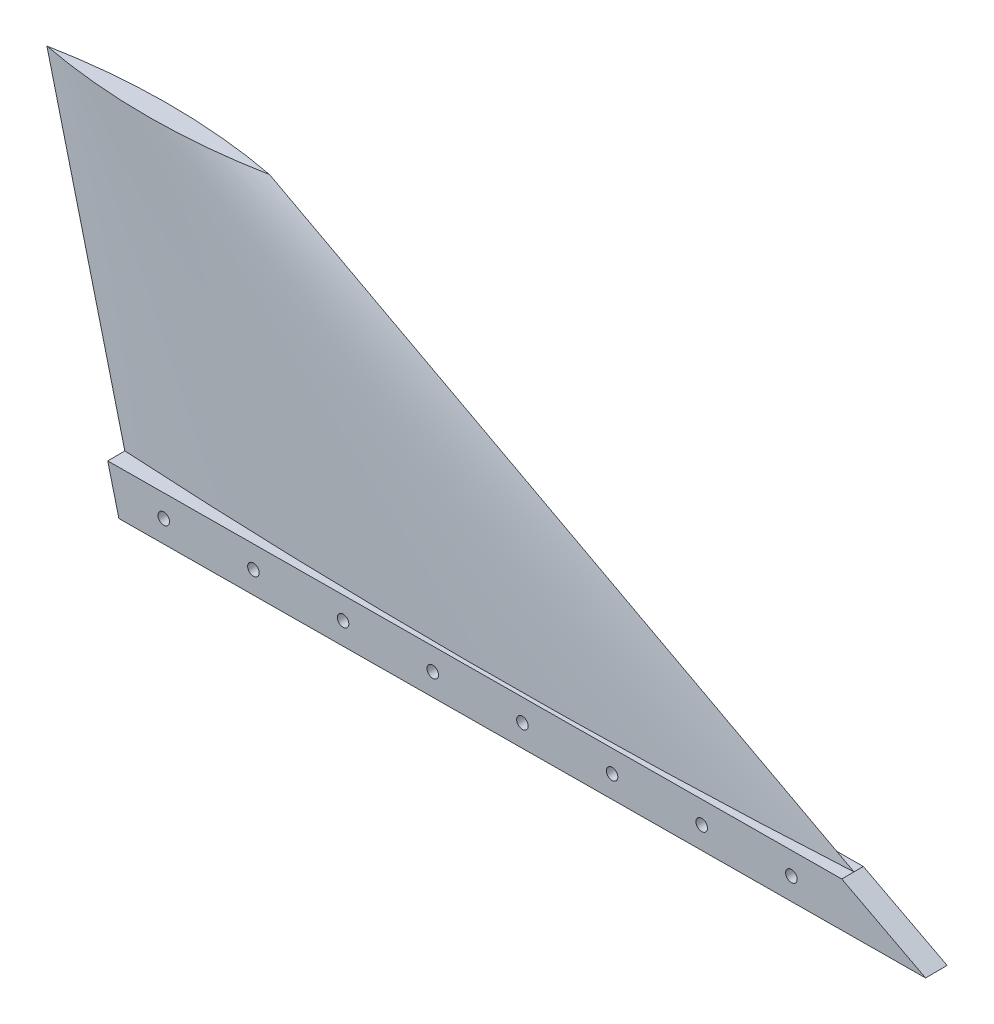
ISO-10303-21;
HEADER;
FILE_DESCRIPTION(('STEP AP214'),'2;1');
FILE_NAME('part.step','',(''),(''),'','','');
FILE_SCHEMA(('AUTOMOTIVE_DESIGN { 1 0 10303 214 1 1 1 1 }'));
ENDSEC;
DATA;
#1=APPLICATION_CONTEXT('core data for automotive mechanical design processes');
#2=APPLICATION_PROTOCOL_DEFINITION('international standard','automotive_design',2000,#1);
#3=PRODUCT_CONTEXT('',#1,'mechanical');
#4=PRODUCT('Part','Part','',(#3));
#5=PRODUCT_RELATED_PRODUCT_CATEGORY('part','',(#4));
#6=PRODUCT_DEFINITION_FORMATION('','',#4);
#7=PRODUCT_DEFINITION_CONTEXT('part definition',#1,'design');
#8=PRODUCT_DEFINITION('design','',#6,#7);
#9=PRODUCT_DEFINITION_SHAPE('','',#8);
#10=(LENGTH_UNIT() NAMED_UNIT(*) SI_UNIT(.MILLI.,.METRE.));
#11=(NAMED_UNIT(*) PLANE_ANGLE_UNIT() SI_UNIT($,.RADIAN.));
#12=(NAMED_UNIT(*) SI_UNIT($,.STERADIAN.) SOLID_ANGLE_UNIT());
#13=UNCERTAINTY_MEASURE_WITH_UNIT(LENGTH_MEASURE(1.E-05),#10,'distance_accuracy_value','');
#14=(GEOMETRIC_REPRESENTATION_CONTEXT(3) GLOBAL_UNCERTAINTY_ASSIGNED_CONTEXT((#13)) GLOBAL_UNIT_ASSIGNED_CONTEXT((#10,
#11,#12)) REPRESENTATION_CONTEXT('',''));
#15=CARTESIAN_POINT('',(0.,0.,0.));
#16=DIRECTION('',(0.,0.,1.));
#17=DIRECTION('',(1.,0.,0.));
#18=AXIS2_PLACEMENT_3D('',#15,#16,#17);
#19=CARTESIAN_POINT('',(-50.7999999999999,203.2,0.));
#20=CARTESIAN_POINT('',(4.9960036108132E-13,0.,0.));
#21=CARTESIAN_POINT('',(-40.4067780264749,203.2,-1.99696806521292));
#22=CARTESIAN_POINT('',(38.0467499197233,0.,-2.01365849787711));
#23=CARTESIAN_POINT('',(-29.872259665938,203.2,-3.51157727112051));
#24=CARTESIAN_POINT('',(76.1334280900938,0.,-3.5249584978771));
#25=CARTESIAN_POINT('',(-8.65839186105809,203.2,-5.53572371619445));
#26=CARTESIAN_POINT('',(152.346731300603,0.,-5.54072924893854));
#27=CARTESIAN_POINT('',(2.0207494933334,203.2,-6.04519999999998));
#28=CARTESIAN_POINT('',(190.473356340742,0.,-6.04519999999999));
#29=CARTESIAN_POINT('',(23.3792505066668,203.2,-6.04519999999996));
#30=CARTESIAN_POINT('',(266.72664365926,0.,-6.04519999999999));
#31=CARTESIAN_POINT('',(34.0583918610582,203.2,-5.53572371619442));
#32=CARTESIAN_POINT('',(304.853268699399,0.,-5.54072924893855));
#33=CARTESIAN_POINT('',(55.2722596659382,203.2,-3.51157727112046));
#34=CARTESIAN_POINT('',(381.066571909908,0.,-3.52495849787711));
#35=CARTESIAN_POINT('',(65.806778026475,203.2,-1.99696806521286));
#36=CARTESIAN_POINT('',(419.153250080279,0.,-2.01365849787711));
#37=CARTESIAN_POINT('',(76.2000000000001,203.2,0.));
#38=CARTESIAN_POINT('',(457.200000000002,0.,0.));
#39=B_SPLINE_SURFACE_WITH_KNOTS('',3,1,((#19,#20),(#21,#22),(#23,#24),(#25,#26),(#27,#28),(#29,
#30),(#31,#32),(#33,#34),(#35,#36),(#37,#38)),.UNSPECIFIED.,.F.,.F.,.F.,(4,2,2,2,4),(2,2),(0.,
0.25,0.5,0.75,1.),(0.,1.),.UNSPECIFIED.);
#40=CARTESIAN_POINT('',(409.575000000002,25.3999999999999,0.));
#41=CARTESIAN_POINT('',(405.617284288982,25.3999999999999,-0.230159422859951));
#42=CARTESIAN_POINT('',(401.659186992657,25.3999999999999,-0.453757299244652));
#43=CARTESIAN_POINT('',(393.742490502231,25.3999999999999,-0.887815238556678));
#44=CARTESIAN_POINT('',(389.783891347722,25.3999999999999,-1.09827602356698));
#45=CARTESIAN_POINT('',(381.866191220855,25.3999999999999,-1.5060614084114));
#46=CARTESIAN_POINT('',(377.907090278258,25.3999999999999,-1.7033865860972));
#47=CARTESIAN_POINT('',(369.988386598123,25.3999999999999,-2.08490122361017));
#48=CARTESIAN_POINT('',(366.028783881475,25.3999999999999,-2.2690911170559));
#49=CARTESIAN_POINT('',(358.109076626838,25.3999999999999,-2.62433464868725));
#50=CARTESIAN_POINT('',(354.148972101825,25.3999999999999,-2.79538857618817));
#51=CARTESIAN_POINT('',(346.228261152961,25.3999999999999,-3.12435859982126));
#52=CARTESIAN_POINT('',(342.267654735127,25.3999999999999,-3.282274840836));
#53=CARTESIAN_POINT('',(334.345939514585,25.3999999999999,-3.58496687564327));
#54=CARTESIAN_POINT('',(330.384830711843,25.3999999999999,-3.72974266851041));
#55=CARTESIAN_POINT('',(322.462110932088,25.3999999999999,-4.00615020320668));
#56=CARTESIAN_POINT('',(318.500499950033,25.3999999999999,-4.13778180052325));
#57=CARTESIAN_POINT('',(310.576775670252,25.3999999999999,-4.3878960287497));
#58=CARTESIAN_POINT('',(306.614662363391,25.3999999999999,-4.50637837027509));
#59=CARTESIAN_POINT('',(298.689933302163,25.3999999999999,-4.73018927112992));
#60=CARTESIAN_POINT('',(294.727317535523,25.3999999999999,-4.83551739593918));
#61=CARTESIAN_POINT('',(286.801583516773,25.3999999999999,-5.03301855933534));
#62=CARTESIAN_POINT('',(282.838465250217,25.3999999999999,-5.12519101822138));
#63=CARTESIAN_POINT('',(274.911726144868,25.3999999999999,-5.29637782965518));
#64=CARTESIAN_POINT('',(270.948105290416,25.3999999999999,-5.37539145713993));
#65=CARTESIAN_POINT('',(266.984364133269,25.3999999999999,-5.44782183625952));
#66=B_SPLINE_CURVE_WITH_KNOTS('',3,(#40,#41,#42,#43,#44,#45,#46,#47,#48,#49,#50,#51,#52,#53,#54,
#55,#56,#57,#58,#59,#60,#61,#62,#63,#64,#65),.UNSPECIFIED.,.F.,.F.,(4,2,2,2,2,2,2,2,2,2,2,2,4),
(0.,11.8932019876838,23.785749686346,35.6777738708504,47.5694052970654,59.4607747388702,
71.3520130251158,83.2432521487796,95.1346219951143,107.026253490935,118.9182776964,
130.810825759022,142.704028894698),.UNSPECIFIED.);
#67=CARTESIAN_POINT('',(409.575000000001,25.3999999999999,0.));
#68=VERTEX_POINT('',#67);
#69=CARTESIAN_POINT('',(302.34021952781,25.3999999999999,-4.62708393592184));
#70=VERTEX_POINT('',#69);
#71=EDGE_CURVE('E181',#68,#70,#66,.T.);
#72=CARTESIAN_POINT('',(368.255113336555,25.3999999999999,-2.16387500239286));
#73=CARTESIAN_POINT('',(340.524015942744,25.3999999999999,-3.45581743465727));
#74=CARTESIAN_POINT('',(312.777888037133,25.3999999999999,-4.42562159020704));
#75=CARTESIAN_POINT('',(257.285612769027,25.3999999999999,-5.71943481517913));
#76=CARTESIAN_POINT('',(229.539473549342,25.3999999999999,-6.04379322302056));
#77=CARTESIAN_POINT('',(173.986921811786,25.3999999999999,-6.04660067572226));
#78=CARTESIAN_POINT('',(146.180509214145,25.3999999999999,-5.72364592991431));
#79=CARTESIAN_POINT('',(90.5676544876334,25.3999999999999,-4.42983416101489));
#80=CARTESIAN_POINT('',(62.7612205369764,25.3999999999999,-3.45862551761243));
#81=CARTESIAN_POINT('',(34.9698866634471,25.4,-2.16387500239286));
#82=B_SPLINE_CURVE_WITH_KNOTS('',3,(#72,#73,#74,#75,#76,#77,#78,#79,#80,#81),.UNSPECIFIED.,.F.,
.F.,(4,2,2,2,4),(0.,83.2816902927023,166.518293270393,249.935601969556,333.398193977609),.UNSPECIFIED.);
#83=CARTESIAN_POINT('',(52.1819470576683,25.3999999999999,-2.9242842904022));
#84=VERTEX_POINT('',#83);
#85=EDGE_CURVE('E138',#70,#84,#82,.T.);
#86=CARTESIAN_POINT('',(136.240635866734,25.3999999999999,-5.44782183625952));
#87=CARTESIAN_POINT('',(132.276894709587,25.3999999999999,-5.37539145713992));
#88=CARTESIAN_POINT('',(128.313273855135,25.3999999999999,-5.29637782965517));
#89=CARTESIAN_POINT('',(120.386534749785,25.3999999999999,-5.12519101822138));
#90=CARTESIAN_POINT('',(116.42341648323,25.3999999999999,-5.03301855933534));
#91=CARTESIAN_POINT('',(108.49768246448,25.3999999999999,-4.83551739593918));
#92=CARTESIAN_POINT('',(104.53506669784,25.3999999999999,-4.73018927112991));
#93=CARTESIAN_POINT('',(96.6103376366108,25.3999999999999,-4.50637837027508));
#94=CARTESIAN_POINT('',(92.6482243297502,25.3999999999999,-4.38789602874969));
#95=CARTESIAN_POINT('',(84.7245000499694,25.3999999999999,-4.13778180052324));
#96=CARTESIAN_POINT('',(80.7628890679146,25.3999999999999,-4.00615020320668));
#97=CARTESIAN_POINT('',(72.8401692881592,25.3999999999999,-3.72974266851041));
#98=CARTESIAN_POINT('',(68.8790604854168,25.3999999999999,-3.58496687564327));
#99=CARTESIAN_POINT('',(60.9573452648755,25.3999999999999,-3.282274840836));
#100=CARTESIAN_POINT('',(56.9967388470412,25.3999999999999,-3.12435859982127));
#101=CARTESIAN_POINT('',(49.0760278981769,25.3999999999999,-2.79538857618817));
#102=CARTESIAN_POINT('',(45.1159233731642,25.3999999999999,-2.62433464868724));
#103=CARTESIAN_POINT('',(37.1962161185267,25.3999999999999,-2.26909111705587));
#104=CARTESIAN_POINT('',(33.2366134018793,25.3999999999999,-2.08490122361013));
#105=CARTESIAN_POINT('',(25.317909721744,25.3999999999999,-1.70338658609715));
#106=CARTESIAN_POINT('',(21.3588087791474,25.3999999999999,-1.50606140841135));
#107=CARTESIAN_POINT('',(13.4411086522802,25.3999999999999,-1.09827602356695));
#108=CARTESIAN_POINT('',(9.48250949777067,25.3999999999999,-0.887815238556656));
#109=CARTESIAN_POINT('',(1.56581300734518,25.3999999999999,-0.453757299244651));
#110=CARTESIAN_POINT('',(-2.39228428898033,25.3999999999999,-0.230159422859958));
#111=CARTESIAN_POINT('',(-6.34999999999954,25.4,0.));
#112=B_SPLINE_CURVE_WITH_KNOTS('',3,(#86,#87,#88,#89,#90,#91,#92,#93,#94,#95,#96,#97,#98,#99,
#100,#101,#102,#103,#104,#105,#106,#107,#108,#109,#110,#111),.UNSPECIFIED.,.F.,.F.,(4,2,2,2,2,2,
2,2,2,2,2,2,4),(0.,11.8932031356756,23.7857511982973,35.6777754037628,47.5694068995834,
59.460776745918,71.3520158695819,83.2432541558274,95.1346235976323,107.026255023847,
118.918279208352,130.810826907014,142.704028894698),.UNSPECIFIED.);
#113=CARTESIAN_POINT('',(-6.34999999999975,25.4,0.));
#114=VERTEX_POINT('',#113);
#115=EDGE_CURVE('E51',#84,#114,#112,.T.);
#116=DIRECTION('',(-0.242535625036335,0.970142500145331,0.));
#117=VECTOR('',#116,1.);
#118=CARTESIAN_POINT('',(-25.3999999999997,101.6,0.));
#119=LINE('',#118,#117);
#120=CARTESIAN_POINT('',(-50.8,203.2,0.));
#121=VERTEX_POINT('',#120);
#122=EDGE_CURVE('E160',#114,#121,#119,.T.);
#123=CARTESIAN_POINT('',(-50.7999999999999,203.2,0.));
#124=CARTESIAN_POINT('',(-40.4067780264749,203.2,-1.99696806521292));
#125=CARTESIAN_POINT('',(-29.872259665938,203.2,-3.51157727112051));
#126=CARTESIAN_POINT('',(-8.65839186105809,203.2,-5.53572371619445));
#127=CARTESIAN_POINT('',(2.0207494933334,203.2,-6.04519999999998));
#128=CARTESIAN_POINT('',(23.3792505066668,203.2,-6.04519999999996));
#129=CARTESIAN_POINT('',(34.0583918610582,203.2,-5.53572371619442));
#130=CARTESIAN_POINT('',(55.2722596659382,203.2,-3.51157727112046));
#131=CARTESIAN_POINT('',(65.806778026475,203.2,-1.99696806521286));
#132=CARTESIAN_POINT('',(76.2000000000001,203.2,0.));
#133=B_SPLINE_CURVE_WITH_KNOTS('',3,(#123,#124,#125,#126,#127,#128,#129,#130,#131,#132),
.UNSPECIFIED.,.F.,.F.,(4,2,2,2,4),(0.,0.25,0.5,0.75,1.),.UNSPECIFIED.);
#134=CARTESIAN_POINT('',(76.2,203.2,0.));
#135=VERTEX_POINT('',#134);
#136=EDGE_CURVE('E286',#121,#135,#133,.T.);
#137=DIRECTION('',(0.882352941176471,-0.470588235294116,0.));
#138=VECTOR('',#137,1.);
#139=CARTESIAN_POINT('',(266.700000000001,101.6,0.));
#140=LINE('',#139,#138);
#141=EDGE_CURVE('E283',#135,#68,#140,.T.);
#142=ORIENTED_EDGE('',*,*,#71,.T.);
#143=ORIENTED_EDGE('',*,*,#85,.T.);
#144=ORIENTED_EDGE('',*,*,#115,.T.);
#145=ORIENTED_EDGE('',*,*,#122,.T.);
#146=ORIENTED_EDGE('',*,*,#136,.T.);
#147=ORIENTED_EDGE('',*,*,#141,.T.);
#148=EDGE_LOOP('',(#142,#143,#144,#145,#146,#147));
#149=FACE_BOUND('',#148,.T.);
#150=ADVANCED_FACE('F41',(#149),#39,.T.);
#151=CARTESIAN_POINT('',(76.1999999999999,203.2,0.));
#152=CARTESIAN_POINT('',(457.200000000001,0.,0.));
#153=CARTESIAN_POINT('',(65.8067780264749,203.2,1.99696806521292));
#154=CARTESIAN_POINT('',(419.153250080278,0.,2.01365849787711));
#155=CARTESIAN_POINT('',(55.272259665938,203.2,3.51157727112051));
#156=CARTESIAN_POINT('',(381.066571909907,0.,3.5249584978771));
#157=CARTESIAN_POINT('',(34.0583918610581,203.2,5.53572371619445));
#158=CARTESIAN_POINT('',(304.853268699398,0.,5.54072924893854));
#159=CARTESIAN_POINT('',(23.3792505066666,203.2,6.04519999999998));
#160=CARTESIAN_POINT('',(266.726643659259,0.,6.04519999999999));
#161=CARTESIAN_POINT('',(2.02074949333326,203.2,6.04519999999997));
#162=CARTESIAN_POINT('',(190.473356340741,0.,6.04519999999999));
#163=CARTESIAN_POINT('',(-8.65839186105825,203.2,5.53572371619443));
#164=CARTESIAN_POINT('',(152.346731300602,0.,5.54072924893855));
#165=CARTESIAN_POINT('',(-29.8722596659381,203.2,3.51157727112046));
#166=CARTESIAN_POINT('',(76.1334280900927,0.,3.52495849787711));
#167=CARTESIAN_POINT('',(-40.406778026475,203.2,1.99696806521286));
#168=CARTESIAN_POINT('',(38.0467499197222,0.,2.01365849787711));
#169=CARTESIAN_POINT('',(-50.8000000000001,203.2,0.));
#170=CARTESIAN_POINT('',(-6.05799965640216E-13,0.,0.));
#171=B_SPLINE_SURFACE_WITH_KNOTS('',3,1,((#151,#152),(#153,#154),(#155,#156),(#157,#158),(#159,
#160),(#161,#162),(#163,#164),(#165,#166),(#167,#168),(#169,#170)),.UNSPECIFIED.,.F.,.F.,.F.,(4,
2,2,2,4),(2,2),(0.,0.25,0.5,0.75,1.),(0.,1.),.UNSPECIFIED.);
#172=CARTESIAN_POINT('',(-6.35000000000053,25.3999999999999,0.));
#173=CARTESIAN_POINT('',(11.7496158182469,25.3999999999999,1.05254968895178));
#174=CARTESIAN_POINT('',(29.8572152505244,25.3999999999999,1.96792103108589));
#175=CARTESIAN_POINT('',(66.0839938436366,25.3999999999999,3.52385650230203));
#176=CARTESIAN_POINT('',(84.2031728597438,25.3999999999999,4.16442400125636));
#177=CARTESIAN_POINT('',(120.449176020014,25.3999999999999,5.17032734707695));
#178=CARTESIAN_POINT('',(138.576000167875,25.3999999999999,5.53566306064736));
#179=CARTESIAN_POINT('',(174.833344857813,25.3999999999999,5.99084469241214));
#180=CARTESIAN_POINT('',(192.963865442498,25.3999999999999,6.08068723181068));
#181=CARTESIAN_POINT('',(227.642965575726,25.3999999999999,5.98875977047559));
#182=CARTESIAN_POINT('',(244.191610520529,25.3999999999999,5.82999419639645));
#183=CARTESIAN_POINT('',(277.285310522527,25.3999999999999,5.28301370619817));
#184=CARTESIAN_POINT('',(293.830365535872,25.3999999999999,4.89479612954149));
#185=CARTESIAN_POINT('',(326.914959113583,25.3999999999999,3.88902955119503));
#186=CARTESIAN_POINT('',(343.454497063326,25.3999999999999,3.27146034278064));
#187=CARTESIAN_POINT('',(376.523239649135,25.3999999999999,1.80736024373821));
#188=CARTESIAN_POINT('',(393.052444405534,25.3999999999999,0.960832071143282));
#189=CARTESIAN_POINT('',(409.575000000001,25.4,0.));
#190=B_SPLINE_CURVE_WITH_KNOTS('',3,(#172,#173,#174,#175,#176,#177,#178,#179,#180,#181,#182,
#183,#184,#185,#186,#187,#188,#189),.UNSPECIFIED.,.F.,.F.,(4,2,2,2,2,2,2,2,4),(0.,
54.3900733211052,108.779479647025,163.168912313935,217.559012039306,267.205665734861,
316.85289510365,366.504499614531,416.155514723799),.UNSPECIFIED.);
#191=EDGE_CURVE('E151',#114,#68,#190,.T.);
#192=CARTESIAN_POINT('',(76.1999999999999,203.2,0.));
#193=CARTESIAN_POINT('',(65.8067780264749,203.2,1.99696806521292));
#194=CARTESIAN_POINT('',(55.272259665938,203.2,3.51157727112051));
#195=CARTESIAN_POINT('',(34.0583918610581,203.2,5.53572371619445));
#196=CARTESIAN_POINT('',(23.3792505066666,203.2,6.04519999999998));
#197=CARTESIAN_POINT('',(2.02074949333326,203.2,6.04519999999997));
#198=CARTESIAN_POINT('',(-8.65839186105825,203.2,5.53572371619443));
#199=CARTESIAN_POINT('',(-29.8722596659381,203.2,3.51157727112046));
#200=CARTESIAN_POINT('',(-40.406778026475,203.2,1.99696806521286));
#201=CARTESIAN_POINT('',(-50.8000000000001,203.2,0.));
#202=B_SPLINE_CURVE_WITH_KNOTS('',3,(#192,#193,#194,#195,#196,#197,#198,#199,#200,#201),
.UNSPECIFIED.,.F.,.F.,(4,2,2,2,4),(0.,0.25,0.5,0.75,1.),.UNSPECIFIED.);
#203=EDGE_CURVE('E65',#135,#121,#202,.T.);
#204=ORIENTED_EDGE('',*,*,#122,.F.);
#205=ORIENTED_EDGE('',*,*,#191,.T.);
#206=ORIENTED_EDGE('',*,*,#141,.F.);
#207=ORIENTED_EDGE('',*,*,#203,.T.);
#208=EDGE_LOOP('',(#204,#205,#206,#207));
#209=FACE_BOUND('',#208,.T.);
#210=ADVANCED_FACE('F162',(#209),#171,.T.);
#211=CARTESIAN_POINT('',(12.7,203.2,0.));
#212=DIRECTION('',(0.,1.,0.));
#213=DIRECTION('',(0.,0.,1.));
#214=AXIS2_PLACEMENT_3D('',#211,#212,#213);
#215=PLANE('',#214);
#216=ORIENTED_EDGE('',*,*,#203,.F.);
#217=ORIENTED_EDGE('',*,*,#136,.F.);
#218=EDGE_LOOP('',(#216,#217));
#219=FACE_BOUND('',#218,.T.);
#220=ADVANCED_FACE('F43',(#219),#215,.T.);
#221=CARTESIAN_POINT('',(409.622562069821,25.3999999999999,6.98734302207143));
#222=DIRECTION('',(-0.470585821016416,-0.882348414405783,0.00320322554717419));
#223=DIRECTION('',(0.882352941176471,-0.470588235294116,0.));
#224=AXIS2_PLACEMENT_3D('',#221,#222,#223);
#225=PLANE('',#224);
#226=DIRECTION('',(-0.882327973864772,0.470596722890842,0.00600590876445357));
#227=VECTOR('',#226,1.);
#228=CARTESIAN_POINT('',(409.622562069821,25.3999999999999,6.98734302207143));
#229=LINE('',#228,#227);
#230=CARTESIAN_POINT('',(457.102487147281,0.076200000000919,6.66415243239845));
#231=VERTEX_POINT('',#230);
#232=CARTESIAN_POINT('',(409.622562069821,25.3999999999999,6.98734302207143));
#233=VERTEX_POINT('',#232);
#234=EDGE_CURVE('E130',#231,#233,#229,.T.);
#235=ORIENTED_EDGE('',*,*,#234,.F.);
#236=DIRECTION('',(-0.00680673152056182,0.,-0.99997683393467));
#237=VECTOR('',#236,1.);
#238=CARTESIAN_POINT('',(457.102487147281,0.0762000000009214,6.66415243239845));
#239=LINE('',#238,#237);
#240=CARTESIAN_POINT('',(457.018462130699,0.0762000000009191,-5.6799615964247));
#241=VERTEX_POINT('',#240);
#242=EDGE_CURVE('E57',#231,#241,#239,.T.);
#243=ORIENTED_EDGE('',*,*,#242,.T.);
#244=DIRECTION('',(-0.882327973864772,0.470596722890842,0.00600590876445357));
#245=VECTOR('',#244,1.);
#246=CARTESIAN_POINT('',(409.538537053238,25.3999999999999,-5.35677100675171));
#247=LINE('',#246,#245);
#248=CARTESIAN_POINT('',(409.538537053238,25.3999999999999,-5.35677100675171));
#249=VERTEX_POINT('',#248);
#250=EDGE_CURVE('E134',#241,#249,#247,.T.);
#251=ORIENTED_EDGE('',*,*,#250,.T.);
#252=DIRECTION('',(-0.00680673152056181,0.,-0.99997683393467));
#253=VECTOR('',#252,1.);
#254=CARTESIAN_POINT('',(409.622562069821,25.3999999999999,6.98734302207143));
#255=LINE('',#254,#253);
#256=EDGE_CURVE('E146',#68,#249,#255,.T.);
#257=ORIENTED_EDGE('',*,*,#256,.F.);
#258=EDGE_CURVE('E147',#233,#68,#255,.T.);
#259=ORIENTED_EDGE('',*,*,#258,.F.);
#260=EDGE_LOOP('',(#235,#243,#251,#257,#259));
#261=FACE_BOUND('',#260,.T.);
#262=ADVANCED_FACE('F177',(#261),#225,.F.);
#263=CARTESIAN_POINT('',(-6.28316746194906,25.3999999999999,9.81836724454967));
#264=DIRECTION('',(0.,-1.,0.));
#265=DIRECTION('',(0.,0.,-1.));
#266=AXIS2_PLACEMENT_3D('',#263,#264,#265);
#267=PLANE('',#266);
#268=ORIENTED_EDGE('',*,*,#71,.F.);
#269=ORIENTED_EDGE('',*,*,#256,.T.);
#270=DIRECTION('',(-0.99997683393467,0.,0.00680673152056181));
#271=VECTOR('',#270,1.);
#272=CARTESIAN_POINT('',(-6.36719247853149,25.3999999999999,-2.52574678427348));
#273=LINE('',#272,#271);
#274=EDGE_CURVE('E139',#249,#70,#273,.T.);
#275=ORIENTED_EDGE('',*,*,#274,.T.);
#276=EDGE_LOOP('',(#268,#269,#275));
#277=FACE_BOUND('',#276,.T.);
#278=ADVANCED_FACE('F174',(#277),#267,.F.);
#279=ORIENTED_EDGE('',*,*,#191,.F.);
#280=DIRECTION('',(-0.00680673152056181,0.,-0.99997683393467));
#281=VECTOR('',#280,1.);
#282=CARTESIAN_POINT('',(-6.28316746194906,25.3999999999999,9.81836724454967));
#283=LINE('',#282,#281);
#284=CARTESIAN_POINT('',(-6.28316746194906,25.3999999999999,9.81836724454967));
#285=VERTEX_POINT('',#284);
#286=EDGE_CURVE('E128',#285,#114,#283,.T.);
#287=ORIENTED_EDGE('',*,*,#286,.F.);
#288=DIRECTION('',(-0.99997683393467,0.,0.00680673152056181));
#289=VECTOR('',#288,1.);
#290=CARTESIAN_POINT('',(-6.28316746194906,25.3999999999999,9.81836724454967));
#291=LINE('',#290,#289);
#292=EDGE_CURVE('E121',#233,#285,#291,.T.);
#293=ORIENTED_EDGE('',*,*,#292,.F.);
#294=ORIENTED_EDGE('',*,*,#258,.T.);
#295=EDGE_LOOP('',(#279,#287,#293,#294));
#296=FACE_BOUND('',#295,.T.);
#297=ADVANCED_FACE('F175',(#296),#267,.F.);
#298=CARTESIAN_POINT('',(0.0665383324290176,9.20097331658098E-13,9.77514550069504));
#299=DIRECTION('',(0.970121347740176,0.242530336935051,-0.00660350853374306));
#300=DIRECTION('',(-0.24253562503634,0.97014250014533,0.));
#301=AXIS2_PLACEMENT_3D('',#298,#299,#300);
#302=PLANE('',#301);
#303=DIRECTION('',(0.242524718461421,-0.970143822155339,-0.00165083888910828));
#304=VECTOR('',#303,1.);
#305=CARTESIAN_POINT('',(-0.0174866841534056,9.20097331658098E-13,-2.56896852812811));
#306=LINE('',#305,#304);
#307=CARTESIAN_POINT('',(-6.36719247853149,25.3999999999999,-2.52574678427348));
#308=VERTEX_POINT('',#307);
#309=CARTESIAN_POINT('',(-0.0365358015365403,0.0762000000009215,-2.56883886289654));
#310=VERTEX_POINT('',#309);
#311=EDGE_CURVE('E114',#308,#310,#306,.T.);
#312=ORIENTED_EDGE('',*,*,#311,.T.);
#313=DIRECTION('',(0.00680673152056179,0.,0.99997683393467));
#314=VECTOR('',#313,1.);
#315=CARTESIAN_POINT('',(-0.0625627527611331,0.0762000000009215,-6.39245790882482));
#316=LINE('',#315,#314);
#317=CARTESIAN_POINT('',(0.0474892150458827,0.0762000000009214,9.7752751659266));
#318=VERTEX_POINT('',#317);
#319=EDGE_CURVE('E102',#310,#318,#316,.T.);
#320=ORIENTED_EDGE('',*,*,#319,.T.);
#321=DIRECTION('',(0.242524718461421,-0.970143822155339,-0.00165083888910828));
#322=VECTOR('',#321,1.);
#323=CARTESIAN_POINT('',(0.0665383324290176,9.20097331658098E-13,9.77514550069504));
#324=LINE('',#323,#322);
#325=EDGE_CURVE('E112',#285,#318,#324,.T.);
#326=ORIENTED_EDGE('',*,*,#325,.F.);
#327=ORIENTED_EDGE('',*,*,#286,.T.);
#328=EDGE_CURVE('E124',#114,#308,#283,.T.);
#329=ORIENTED_EDGE('',*,*,#328,.T.);
#330=EDGE_LOOP('',(#312,#320,#326,#327,#329));
#331=FACE_BOUND('',#330,.T.);
#332=ADVANCED_FACE('F110',(#331),#302,.F.);
#333=CARTESIAN_POINT('',(-0.0174866841534083,0.,-2.56896852812811));
#334=DIRECTION('',(0.00680673152056181,0.,0.99997683393467));
#335=DIRECTION('',(0.99997683393467,0.,-0.00680673152056181));
#336=AXIS2_PLACEMENT_3D('',#333,#334,#335);
#337=PLANE('',#336);
#338=CARTESIAN_POINT('',(380.965449382963,12.7,-5.16227716460963));
#339=DIRECTION('',(0.00680673152056181,0.,0.99997683393467));
#340=DIRECTION('',(0.99997683393467,0.,-0.00680673152056181));
#341=AXIS2_PLACEMENT_3D('',#338,#339,#340);
#342=CIRCLE('',#341,3.26389999999999);
#343=CARTESIAN_POINT('',(384.229273771243,12.7,-5.18449365561959));
#344=VERTEX_POINT('',#343);
#345=EDGE_CURVE('E243',#344,#344,#342,.T.);
#346=ORIENTED_EDGE('',*,*,#345,.T.);
#347=EDGE_LOOP('',(#346));
#348=FACE_BOUND('',#347,.T.);
#349=CARTESIAN_POINT('',(330.167803027938,12.7,-4.81650321377259));
#350=DIRECTION('',(0.00680673152056181,0.,0.99997683393467));
#351=DIRECTION('',(0.99997683393467,0.,-0.00680673152056181));
#352=AXIS2_PLACEMENT_3D('',#349,#350,#351);
#353=CIRCLE('',#352,3.26389999999999);
#354=CARTESIAN_POINT('',(333.431627416217,12.7,-4.83871970478255));
#355=VERTEX_POINT('',#354);
#356=EDGE_CURVE('E247',#355,#355,#353,.T.);
#357=ORIENTED_EDGE('',*,*,#356,.T.);
#358=EDGE_LOOP('',(#357));
#359=FACE_BOUND('',#358,.T.);
#360=CARTESIAN_POINT('',(279.370156672913,12.7,-4.47072926293556));
#361=DIRECTION('',(0.00680673152056181,0.,0.99997683393467));
#362=DIRECTION('',(0.99997683393467,0.,-0.00680673152056181));
#363=AXIS2_PLACEMENT_3D('',#360,#361,#362);
#364=CIRCLE('',#363,3.26389999999999);
#365=CARTESIAN_POINT('',(282.633981061192,12.7,-4.49294575394552));
#366=VERTEX_POINT('',#365);
#367=EDGE_CURVE('E251',#366,#366,#364,.T.);
#368=ORIENTED_EDGE('',*,*,#367,.T.);
#369=EDGE_LOOP('',(#368));
#370=FACE_BOUND('',#369,.T.);
#371=CARTESIAN_POINT('',(228.572510317888,12.7,-4.12495531209852));
#372=DIRECTION('',(0.00680673152056181,0.,0.99997683393467));
#373=DIRECTION('',(0.99997683393467,0.,-0.00680673152056181));
#374=AXIS2_PLACEMENT_3D('',#371,#372,#373);
#375=CIRCLE('',#374,3.26389999999999);
#376=CARTESIAN_POINT('',(231.836334706167,12.7,-4.14717180310848));
#377=VERTEX_POINT('',#376);
#378=EDGE_CURVE('E255',#377,#377,#375,.T.);
#379=ORIENTED_EDGE('',*,*,#378,.T.);
#380=EDGE_LOOP('',(#379));
#381=FACE_BOUND('',#380,.T.);
#382=CARTESIAN_POINT('',(177.774863962863,12.7,-3.77918136126148));
#383=DIRECTION('',(0.00680673152056181,0.,0.99997683393467));
#384=DIRECTION('',(0.99997683393467,0.,-0.00680673152056181));
#385=AXIS2_PLACEMENT_3D('',#382,#383,#384);
#386=CIRCLE('',#385,3.26389999999999);
#387=CARTESIAN_POINT('',(181.038688351142,12.7,-3.80139785227145));
#388=VERTEX_POINT('',#387);
#389=EDGE_CURVE('E259',#388,#388,#386,.T.);
#390=ORIENTED_EDGE('',*,*,#389,.T.);
#391=EDGE_LOOP('',(#390));
#392=FACE_BOUND('',#391,.T.);
#393=CARTESIAN_POINT('',(126.977217607838,12.7,-3.43340741042445));
#394=DIRECTION('',(0.00680673152056181,0.,0.99997683393467));
#395=DIRECTION('',(0.99997683393467,0.,-0.00680673152056181));
#396=AXIS2_PLACEMENT_3D('',#393,#394,#395);
#397=CIRCLE('',#396,3.26389999999999);
#398=CARTESIAN_POINT('',(130.241041996117,12.7,-3.45562390143441));
#399=VERTEX_POINT('',#398);
#400=EDGE_CURVE('E263',#399,#399,#397,.T.);
#401=ORIENTED_EDGE('',*,*,#400,.T.);
#402=EDGE_LOOP('',(#401));
#403=FACE_BOUND('',#402,.T.);
#404=CARTESIAN_POINT('',(76.1795712528124,12.7,-3.08763345958741));
#405=DIRECTION('',(0.00680673152056181,0.,0.99997683393467));
#406=DIRECTION('',(0.99997683393467,0.,-0.00680673152056181));
#407=AXIS2_PLACEMENT_3D('',#404,#405,#406);
#408=CIRCLE('',#407,3.26389999999999);
#409=CARTESIAN_POINT('',(79.4433956410917,12.7,-3.10984995059737));
#410=VERTEX_POINT('',#409);
#411=EDGE_CURVE('E267',#410,#410,#408,.T.);
#412=ORIENTED_EDGE('',*,*,#411,.T.);
#413=EDGE_LOOP('',(#412));
#414=FACE_BOUND('',#413,.T.);
#415=CARTESIAN_POINT('',(25.3819248977872,12.7,-2.74185950875037));
#416=DIRECTION('',(0.00680673152056181,0.,0.99997683393467));
#417=DIRECTION('',(0.99997683393467,0.,-0.00680673152056181));
#418=AXIS2_PLACEMENT_3D('',#415,#416,#417);
#419=CIRCLE('',#418,3.26389999999999);
#420=CARTESIAN_POINT('',(28.6457492860666,12.7,-2.76407599976034));
#421=VERTEX_POINT('',#420);
#422=EDGE_CURVE('E195',#421,#421,#419,.T.);
#423=ORIENTED_EDGE('',*,*,#422,.T.);
#424=EDGE_LOOP('',(#423));
#425=FACE_BOUND('',#424,.T.);
#426=ORIENTED_EDGE('',*,*,#250,.F.);
#427=DIRECTION('',(-0.99997683393467,0.,0.00680673152056181));
#428=VECTOR('',#427,1.);
#429=CARTESIAN_POINT('',(-0.0174866841534083,0.0762000000009215,-2.56896852812811));
#430=LINE('',#429,#428);
#431=EDGE_CURVE('E116',#241,#310,#430,.T.);
#432=ORIENTED_EDGE('',*,*,#431,.T.);
#433=ORIENTED_EDGE('',*,*,#311,.F.);
#434=EDGE_CURVE('E137',#84,#308,#273,.T.);
#435=ORIENTED_EDGE('',*,*,#434,.F.);
#436=DIRECTION('',(-0.99997683393467,0.,0.00680673152056181));
#437=VECTOR('',#436,1.);
#438=CARTESIAN_POINT('',(457.247843840744,25.3999999999999,-5.68152297231163));
#439=LINE('',#438,#437);
#440=EDGE_CURVE('E224',#70,#84,#439,.T.);
#441=ORIENTED_EDGE('',*,*,#440,.F.);
#442=ORIENTED_EDGE('',*,*,#274,.F.);
#443=EDGE_LOOP('',(#426,#432,#433,#435,#441,#442));
#444=FACE_BOUND('',#443,.T.);
#445=ADVANCED_FACE('F172',(#348,#359,#370,#381,#392,#403,#414,#425,#444),#337,.F.);
#446=ORIENTED_EDGE('',*,*,#115,.F.);
#447=ORIENTED_EDGE('',*,*,#434,.T.);
#448=ORIENTED_EDGE('',*,*,#328,.F.);
#449=EDGE_LOOP('',(#446,#447,#448));
#450=FACE_BOUND('',#449,.T.);
#451=ADVANCED_FACE('F167',(#450),#267,.F.);
#452=CARTESIAN_POINT('',(0.0665383324290148,0.,9.77514550069504));
#453=DIRECTION('',(0.00680673152056181,0.,0.99997683393467));
#454=DIRECTION('',(0.99997683393467,0.,-0.00680673152056181));
#455=AXIS2_PLACEMENT_3D('',#452,#453,#454);
#456=PLANE('',#455);
#457=DIRECTION('',(-0.99997683393467,0.,0.00680673152056181));
#458=VECTOR('',#457,1.);
#459=CARTESIAN_POINT('',(0.0665383324290148,0.0762000000009214,9.77514550069504));
#460=LINE('',#459,#458);
#461=EDGE_CURVE('E11',#231,#318,#460,.T.);
#462=ORIENTED_EDGE('',*,*,#461,.F.);
#463=ORIENTED_EDGE('',*,*,#234,.T.);
#464=ORIENTED_EDGE('',*,*,#292,.T.);
#465=ORIENTED_EDGE('',*,*,#325,.T.);
#466=EDGE_LOOP('',(#462,#463,#464,#465));
#467=FACE_BOUND('',#466,.T.);
#468=CARTESIAN_POINT('',(381.049474399546,12.7,7.18183686421352));
#469=DIRECTION('',(0.00680673152056181,0.,0.99997683393467));
#470=DIRECTION('',(0.99997683393467,0.,-0.00680673152056181));
#471=AXIS2_PLACEMENT_3D('',#468,#469,#470);
#472=CIRCLE('',#471,3.26389999999999);
#473=CARTESIAN_POINT('',(384.313298787825,12.7,7.15962037320356));
#474=VERTEX_POINT('',#473);
#475=EDGE_CURVE('E485',#474,#474,#472,.T.);
#476=ORIENTED_EDGE('',*,*,#475,.F.);
#477=EDGE_LOOP('',(#476));
#478=FACE_BOUND('',#477,.T.);
#479=CARTESIAN_POINT('',(330.251828044521,12.7,7.52761081505055));
#480=DIRECTION('',(0.00680673152056181,0.,0.99997683393467));
#481=DIRECTION('',(0.99997683393467,0.,-0.00680673152056181));
#482=AXIS2_PLACEMENT_3D('',#479,#480,#481);
#483=CIRCLE('',#482,3.26389999999999);
#484=CARTESIAN_POINT('',(333.5156524328,12.7,7.50539432404059));
#485=VERTEX_POINT('',#484);
#486=EDGE_CURVE('E489',#485,#485,#483,.T.);
#487=ORIENTED_EDGE('',*,*,#486,.F.);
#488=EDGE_LOOP('',(#487));
#489=FACE_BOUND('',#488,.T.);
#490=CARTESIAN_POINT('',(279.454181689495,12.7,7.87338476588759));
#491=DIRECTION('',(0.00680673152056181,0.,0.99997683393467));
#492=DIRECTION('',(0.99997683393467,0.,-0.00680673152056181));
#493=AXIS2_PLACEMENT_3D('',#490,#491,#492);
#494=CIRCLE('',#493,3.26389999999999);
#495=CARTESIAN_POINT('',(282.718006077775,12.7,7.85116827487763));
#496=VERTEX_POINT('',#495);
#497=EDGE_CURVE('E496',#496,#496,#494,.T.);
#498=ORIENTED_EDGE('',*,*,#497,.F.);
#499=EDGE_LOOP('',(#498));
#500=FACE_BOUND('',#499,.T.);
#501=CARTESIAN_POINT('',(228.65653533447,12.7,8.21915871672462));
#502=DIRECTION('',(0.00680673152056181,0.,0.99997683393467));
#503=DIRECTION('',(0.99997683393467,0.,-0.00680673152056181));
#504=AXIS2_PLACEMENT_3D('',#501,#502,#503);
#505=CIRCLE('',#504,3.26389999999999);
#506=CARTESIAN_POINT('',(231.92035972275,12.7,8.19694222571466));
#507=VERTEX_POINT('',#506);
#508=EDGE_CURVE('E500',#507,#507,#505,.T.);
#509=ORIENTED_EDGE('',*,*,#508,.F.);
#510=EDGE_LOOP('',(#509));
#511=FACE_BOUND('',#510,.T.);
#512=CARTESIAN_POINT('',(177.858888979445,12.7,8.56493266756166));
#513=DIRECTION('',(0.00680673152056181,0.,0.99997683393467));
#514=DIRECTION('',(0.99997683393467,0.,-0.00680673152056181));
#515=AXIS2_PLACEMENT_3D('',#512,#513,#514);
#516=CIRCLE('',#515,3.26389999999999);
#517=CARTESIAN_POINT('',(181.122713367724,12.7,8.5427161765517));
#518=VERTEX_POINT('',#517);
#519=EDGE_CURVE('E504',#518,#518,#516,.T.);
#520=ORIENTED_EDGE('',*,*,#519,.F.);
#521=EDGE_LOOP('',(#520));
#522=FACE_BOUND('',#521,.T.);
#523=CARTESIAN_POINT('',(127.06124262442,12.7,8.91070661839869));
#524=DIRECTION('',(0.00680673152056181,0.,0.99997683393467));
#525=DIRECTION('',(0.99997683393467,0.,-0.00680673152056181));
#526=AXIS2_PLACEMENT_3D('',#523,#524,#525);
#527=CIRCLE('',#526,3.26389999999999);
#528=CARTESIAN_POINT('',(130.325067012699,12.7,8.88849012738873));
#529=VERTEX_POINT('',#528);
#530=EDGE_CURVE('E509',#529,#529,#527,.T.);
#531=ORIENTED_EDGE('',*,*,#530,.F.);
#532=EDGE_LOOP('',(#531));
#533=FACE_BOUND('',#532,.T.);
#534=CARTESIAN_POINT('',(76.2635962693948,12.7,9.25648056923573));
#535=DIRECTION('',(0.00680673152056181,0.,0.99997683393467));
#536=DIRECTION('',(0.99997683393467,0.,-0.00680673152056181));
#537=AXIS2_PLACEMENT_3D('',#534,#535,#536);
#538=CIRCLE('',#537,3.26389999999999);
#539=CARTESIAN_POINT('',(79.5274206576742,12.7,9.23426407822577));
#540=VERTEX_POINT('',#539);
#541=EDGE_CURVE('E511',#540,#540,#538,.T.);
#542=ORIENTED_EDGE('',*,*,#541,.F.);
#543=EDGE_LOOP('',(#542));
#544=FACE_BOUND('',#543,.T.);
#545=CARTESIAN_POINT('',(25.4659499143696,12.7,9.60225452007277));
#546=DIRECTION('',(0.00680673152056181,0.,0.99997683393467));
#547=DIRECTION('',(0.99997683393467,0.,-0.00680673152056181));
#548=AXIS2_PLACEMENT_3D('',#545,#546,#547);
#549=CIRCLE('',#548,3.26389999999999);
#550=CARTESIAN_POINT('',(28.729774302649,12.7,9.58003802906281));
#551=VERTEX_POINT('',#550);
#552=EDGE_CURVE('E521',#551,#551,#549,.T.);
#553=ORIENTED_EDGE('',*,*,#552,.F.);
#554=EDGE_LOOP('',(#553));
#555=FACE_BOUND('',#554,.T.);
#556=ADVANCED_FACE('F118',(#467,#478,#489,#500,#511,#522,#533,#544,#555),#456,.T.);
#557=CARTESIAN_POINT('',(457.265330524897,25.3999999999999,-3.11255444418353));
#558=DIRECTION('',(0.,-1.,0.));
#559=DIRECTION('',(0.,0.,-1.));
#560=AXIS2_PLACEMENT_3D('',#557,#558,#559);
#561=PLANE('',#560);
#562=ORIENTED_EDGE('',*,*,#440,.T.);
#563=ORIENTED_EDGE('',*,*,#85,.F.);
#564=EDGE_LOOP('',(#562,#563));
#565=FACE_BOUND('',#564,.T.);
#566=ADVANCED_FACE('F226',(#565),#561,.T.);
#567=CARTESIAN_POINT('',(25.4964484746386,12.7,14.0827975891147));
#568=DIRECTION('',(0.00680673152056181,0.,0.99997683393467));
#569=DIRECTION('',(0.99997683393467,0.,-0.00680673152056181));
#570=AXIS2_PLACEMENT_3D('',#567,#568,#569);
#571=CYLINDRICAL_SURFACE('',#570,3.26389999999999);
#572=ORIENTED_EDGE('',*,*,#552,.T.);
#573=EDGE_LOOP('',(#572));
#574=FACE_BOUND('',#573,.T.);
#575=ORIENTED_EDGE('',*,*,#422,.F.);
#576=EDGE_LOOP('',(#575));
#577=FACE_BOUND('',#576,.T.);
#578=ADVANCED_FACE('F231',(#574,#577),#571,.F.);
#579=CARTESIAN_POINT('',(76.2964484746386,12.7,14.0827975891147));
#580=DIRECTION('',(0.00680673152056181,0.,0.99997683393467));
#581=DIRECTION('',(0.99997683393467,0.,-0.00680673152056181));
#582=AXIS2_PLACEMENT_3D('',#579,#580,#581);
#583=CYLINDRICAL_SURFACE('',#582,3.26389999999999);
#584=ORIENTED_EDGE('',*,*,#541,.T.);
#585=EDGE_LOOP('',(#584));
#586=FACE_BOUND('',#585,.T.);
#587=ORIENTED_EDGE('',*,*,#411,.F.);
#588=EDGE_LOOP('',(#587));
#589=FACE_BOUND('',#588,.T.);
#590=ADVANCED_FACE('F372',(#586,#589),#583,.F.);
#591=CARTESIAN_POINT('',(127.096448474639,12.7,14.0827975891147));
#592=DIRECTION('',(0.00680673152056181,0.,0.99997683393467));
#593=DIRECTION('',(0.99997683393467,0.,-0.00680673152056181));
#594=AXIS2_PLACEMENT_3D('',#591,#592,#593);
#595=CYLINDRICAL_SURFACE('',#594,3.26389999999999);
#596=ORIENTED_EDGE('',*,*,#530,.T.);
#597=EDGE_LOOP('',(#596));
#598=FACE_BOUND('',#597,.T.);
#599=ORIENTED_EDGE('',*,*,#400,.F.);
#600=EDGE_LOOP('',(#599));
#601=FACE_BOUND('',#600,.T.);
#602=ADVANCED_FACE('F381',(#598,#601),#595,.F.);
#603=CARTESIAN_POINT('',(177.896448474639,12.7,14.0827975891147));
#604=DIRECTION('',(0.00680673152056181,0.,0.99997683393467));
#605=DIRECTION('',(0.99997683393467,0.,-0.00680673152056181));
#606=AXIS2_PLACEMENT_3D('',#603,#604,#605);
#607=CYLINDRICAL_SURFACE('',#606,3.26389999999999);
#608=ORIENTED_EDGE('',*,*,#519,.T.);
#609=EDGE_LOOP('',(#608));
#610=FACE_BOUND('',#609,.T.);
#611=ORIENTED_EDGE('',*,*,#389,.F.);
#612=EDGE_LOOP('',(#611));
#613=FACE_BOUND('',#612,.T.);
#614=ADVANCED_FACE('F390',(#610,#613),#607,.F.);
#615=CARTESIAN_POINT('',(228.696448474639,12.7,14.0827975891147));
#616=DIRECTION('',(0.00680673152056181,0.,0.99997683393467));
#617=DIRECTION('',(0.99997683393467,0.,-0.00680673152056181));
#618=AXIS2_PLACEMENT_3D('',#615,#616,#617);
#619=CYLINDRICAL_SURFACE('',#618,3.26389999999999);
#620=ORIENTED_EDGE('',*,*,#508,.T.);
#621=EDGE_LOOP('',(#620));
#622=FACE_BOUND('',#621,.T.);
#623=ORIENTED_EDGE('',*,*,#378,.F.);
#624=EDGE_LOOP('',(#623));
#625=FACE_BOUND('',#624,.T.);
#626=ADVANCED_FACE('F400',(#622,#625),#619,.F.);
#627=CARTESIAN_POINT('',(279.496448474639,12.7,14.0827975891147));
#628=DIRECTION('',(0.00680673152056181,0.,0.99997683393467));
#629=DIRECTION('',(0.99997683393467,0.,-0.00680673152056181));
#630=AXIS2_PLACEMENT_3D('',#627,#628,#629);
#631=CYLINDRICAL_SURFACE('',#630,3.26389999999999);
#632=ORIENTED_EDGE('',*,*,#497,.T.);
#633=EDGE_LOOP('',(#632));
#634=FACE_BOUND('',#633,.T.);
#635=ORIENTED_EDGE('',*,*,#367,.F.);
#636=EDGE_LOOP('',(#635));
#637=FACE_BOUND('',#636,.T.);
#638=ADVANCED_FACE('F410',(#634,#637),#631,.F.);
#639=CARTESIAN_POINT('',(330.296448474639,12.7,14.0827975891147));
#640=DIRECTION('',(0.00680673152056181,0.,0.99997683393467));
#641=DIRECTION('',(0.99997683393467,0.,-0.00680673152056181));
#642=AXIS2_PLACEMENT_3D('',#639,#640,#641);
#643=CYLINDRICAL_SURFACE('',#642,3.26389999999999);
#644=ORIENTED_EDGE('',*,*,#486,.T.);
#645=EDGE_LOOP('',(#644));
#646=FACE_BOUND('',#645,.T.);
#647=ORIENTED_EDGE('',*,*,#356,.F.);
#648=EDGE_LOOP('',(#647));
#649=FACE_BOUND('',#648,.T.);
#650=ADVANCED_FACE('F420',(#646,#649),#643,.F.);
#651=CARTESIAN_POINT('',(381.096448474639,12.7,14.0827975891147));
#652=DIRECTION('',(0.00680673152056181,0.,0.99997683393467));
#653=DIRECTION('',(0.99997683393467,0.,-0.00680673152056181));
#654=AXIS2_PLACEMENT_3D('',#651,#652,#653);
#655=CYLINDRICAL_SURFACE('',#654,3.26389999999999);
#656=ORIENTED_EDGE('',*,*,#475,.T.);
#657=EDGE_LOOP('',(#656));
#658=FACE_BOUND('',#657,.T.);
#659=ORIENTED_EDGE('',*,*,#345,.F.);
#660=EDGE_LOOP('',(#659));
#661=FACE_BOUND('',#660,.T.);
#662=ADVANCED_FACE('F430',(#658,#661),#655,.F.);
#663=CARTESIAN_POINT('',(-0.0625627527611331,0.0762000000009215,-6.39245790882482));
#664=DIRECTION('',(0.,1.,0.));
#665=DIRECTION('',(0.,0.,1.));
#666=AXIS2_PLACEMENT_3D('',#663,#664,#665);
#667=PLANE('',#666);
#668=ORIENTED_EDGE('',*,*,#461,.T.);
#669=ORIENTED_EDGE('',*,*,#319,.F.);
#670=ORIENTED_EDGE('',*,*,#431,.F.);
#671=ORIENTED_EDGE('',*,*,#242,.F.);
#672=EDGE_LOOP('',(#668,#669,#670,#671));
#673=FACE_BOUND('',#672,.T.);
#674=ADVANCED_FACE('F101',(#673),#667,.F.);
#675=CLOSED_SHELL('',(#150,#210,#220,#262,#278,#297,#332,#445,#451,#556,#566,#578,#590,#602,
#614,#626,#638,#650,#662,#674));
#676=MANIFOLD_SOLID_BREP('B2',#675);
#677=ADVANCED_BREP_SHAPE_REPRESENTATION('',(#18,#676),#14);
#678=SHAPE_DEFINITION_REPRESENTATION(#9,#677);
ENDSEC;
END-ISO-10303-21;
